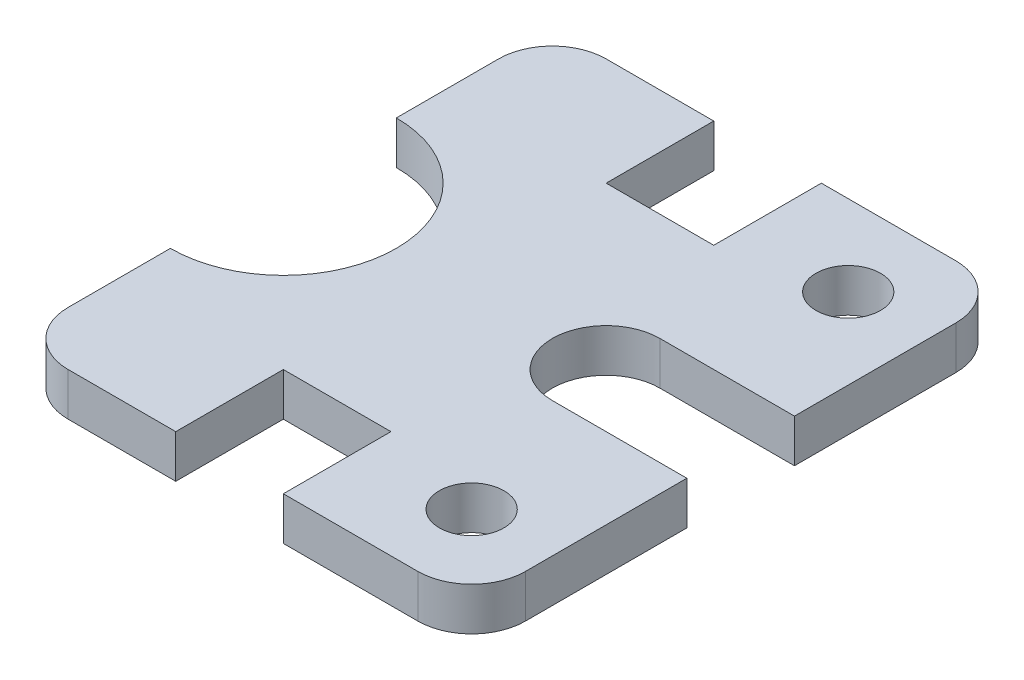
ISO-10303-21;
HEADER;
FILE_DESCRIPTION(('STEP AP214'),'2;1');
FILE_NAME('part.step','',(''),(''),'','','');
FILE_SCHEMA(('AUTOMOTIVE_DESIGN { 1 0 10303 214 1 1 1 1 }'));
ENDSEC;
DATA;
#1=APPLICATION_CONTEXT('core data for automotive mechanical design processes');
#2=APPLICATION_PROTOCOL_DEFINITION('international standard','automotive_design',2000,#1);
#3=PRODUCT_CONTEXT('',#1,'mechanical');
#4=PRODUCT('Part','Part','',(#3));
#5=PRODUCT_RELATED_PRODUCT_CATEGORY('part','',(#4));
#6=PRODUCT_DEFINITION_FORMATION('','',#4);
#7=PRODUCT_DEFINITION_CONTEXT('part definition',#1,'design');
#8=PRODUCT_DEFINITION('design','',#6,#7);
#9=PRODUCT_DEFINITION_SHAPE('','',#8);
#10=(LENGTH_UNIT() NAMED_UNIT(*) SI_UNIT(.MILLI.,.METRE.));
#11=(NAMED_UNIT(*) PLANE_ANGLE_UNIT() SI_UNIT($,.RADIAN.));
#12=(NAMED_UNIT(*) SI_UNIT($,.STERADIAN.) SOLID_ANGLE_UNIT());
#13=UNCERTAINTY_MEASURE_WITH_UNIT(LENGTH_MEASURE(1.E-05),#10,'distance_accuracy_value','');
#14=(GEOMETRIC_REPRESENTATION_CONTEXT(3) GLOBAL_UNCERTAINTY_ASSIGNED_CONTEXT((#13)) GLOBAL_UNIT_ASSIGNED_CONTEXT((#10,
#11,#12)) REPRESENTATION_CONTEXT('',''));
#15=CARTESIAN_POINT('',(0.,0.,0.));
#16=DIRECTION('',(0.,0.,1.));
#17=DIRECTION('',(1.,0.,0.));
#18=AXIS2_PLACEMENT_3D('',#15,#16,#17);
#19=CARTESIAN_POINT('',(0.,8.,10.));
#20=DIRECTION('',(0.,1.,0.));
#21=DIRECTION('',(0.,0.,1.));
#22=AXIS2_PLACEMENT_3D('',#19,#20,#21);
#23=PLANE('',#22);
#24=CARTESIAN_POINT('',(10.,8.,45.));
#25=DIRECTION('',(0.,1.,0.));
#26=DIRECTION('',(0.,0.,1.));
#27=AXIS2_PLACEMENT_3D('',#24,#25,#26);
#28=CIRCLE('',#27,6.);
#29=CARTESIAN_POINT('',(10.,8.,51.));
#30=VERTEX_POINT('',#29);
#31=EDGE_CURVE('E221',#30,#30,#28,.T.);
#32=ORIENTED_EDGE('',*,*,#31,.F.);
#33=EDGE_LOOP('',(#32));
#34=FACE_BOUND('',#33,.T.);
#35=CARTESIAN_POINT('',(0.,8.,10.));
#36=DIRECTION('',(0.,-1.,0.));
#37=DIRECTION('',(0.,0.,1.));
#38=AXIS2_PLACEMENT_3D('',#35,#36,#37);
#39=CIRCLE('',#38,10.);
#40=CARTESIAN_POINT('',(0.,8.,20.));
#41=VERTEX_POINT('',#40);
#42=CARTESIAN_POINT('',(0.,8.,0.));
#43=VERTEX_POINT('',#42);
#44=EDGE_CURVE('E260',#41,#43,#39,.T.);
#45=ORIENTED_EDGE('',*,*,#44,.T.);
#46=DIRECTION('',(1.,0.,0.));
#47=VECTOR('',#46,1.);
#48=CARTESIAN_POINT('',(0.,8.,0.));
#49=LINE('',#48,#47);
#50=CARTESIAN_POINT('',(25.,8.,0.));
#51=VERTEX_POINT('',#50);
#52=EDGE_CURVE('E138',#43,#51,#49,.T.);
#53=ORIENTED_EDGE('',*,*,#52,.T.);
#54=DIRECTION('',(0.,0.,-1.));
#55=VECTOR('',#54,1.);
#56=CARTESIAN_POINT('',(25.,8.,-29.9999999999999));
#57=LINE('',#56,#55);
#58=CARTESIAN_POINT('',(25.,8.,-29.9999999999999));
#59=VERTEX_POINT('',#58);
#60=EDGE_CURVE('E317',#51,#59,#57,.T.);
#61=ORIENTED_EDGE('',*,*,#60,.T.);
#62=CARTESIAN_POINT('',(15.,8.,-30.));
#63=DIRECTION('',(0.,1.,0.));
#64=DIRECTION('',(0.,0.,1.));
#65=AXIS2_PLACEMENT_3D('',#62,#63,#64);
#66=CIRCLE('',#65,10.);
#67=CARTESIAN_POINT('',(14.9999999999999,8.,-40.));
#68=VERTEX_POINT('',#67);
#69=EDGE_CURVE('E336',#59,#68,#66,.T.);
#70=ORIENTED_EDGE('',*,*,#69,.T.);
#71=DIRECTION('',(-1.,0.,0.));
#72=VECTOR('',#71,1.);
#73=CARTESIAN_POINT('',(-9.99999999999999,8.,-40.));
#74=LINE('',#73,#72);
#75=CARTESIAN_POINT('',(-9.99999999999999,8.,-40.));
#76=VERTEX_POINT('',#75);
#77=EDGE_CURVE('E333',#68,#76,#74,.T.);
#78=ORIENTED_EDGE('',*,*,#77,.T.);
#79=DIRECTION('',(0.,0.,1.));
#80=VECTOR('',#79,1.);
#81=CARTESIAN_POINT('',(-9.99999999999999,8.,-20.));
#82=LINE('',#81,#80);
#83=CARTESIAN_POINT('',(-9.99999999999999,8.,-20.));
#84=VERTEX_POINT('',#83);
#85=EDGE_CURVE('E335',#76,#84,#82,.T.);
#86=ORIENTED_EDGE('',*,*,#85,.T.);
#87=DIRECTION('',(-1.,0.,0.));
#88=VECTOR('',#87,1.);
#89=CARTESIAN_POINT('',(-30.,8.,-20.));
#90=LINE('',#89,#88);
#91=CARTESIAN_POINT('',(-30.,8.,-20.));
#92=VERTEX_POINT('',#91);
#93=EDGE_CURVE('E338',#84,#92,#90,.T.);
#94=ORIENTED_EDGE('',*,*,#93,.T.);
#95=DIRECTION('',(0.,0.,-1.));
#96=VECTOR('',#95,1.);
#97=CARTESIAN_POINT('',(-30.,8.,-40.));
#98=LINE('',#97,#96);
#99=CARTESIAN_POINT('',(-30.,8.,-40.));
#100=VERTEX_POINT('',#99);
#101=EDGE_CURVE('E344',#92,#100,#98,.T.);
#102=ORIENTED_EDGE('',*,*,#101,.T.);
#103=DIRECTION('',(-1.,0.,0.));
#104=VECTOR('',#103,1.);
#105=CARTESIAN_POINT('',(-50.,8.,-40.));
#106=LINE('',#105,#104);
#107=CARTESIAN_POINT('',(-50.,8.,-40.));
#108=VERTEX_POINT('',#107);
#109=EDGE_CURVE('E346',#100,#108,#106,.T.);
#110=ORIENTED_EDGE('',*,*,#109,.T.);
#111=CARTESIAN_POINT('',(-50.,8.,-30.));
#112=DIRECTION('',(0.,1.,0.));
#113=DIRECTION('',(0.,0.,-1.));
#114=AXIS2_PLACEMENT_3D('',#111,#112,#113);
#115=CIRCLE('',#114,10.);
#116=CARTESIAN_POINT('',(-60.,8.,-30.));
#117=VERTEX_POINT('',#116);
#118=EDGE_CURVE('E348',#108,#117,#115,.T.);
#119=ORIENTED_EDGE('',*,*,#118,.T.);
#120=DIRECTION('',(0.,0.,1.));
#121=VECTOR('',#120,1.);
#122=CARTESIAN_POINT('',(-60.,8.,-11.));
#123=LINE('',#122,#121);
#124=CARTESIAN_POINT('',(-60.,8.,-11.));
#125=VERTEX_POINT('',#124);
#126=EDGE_CURVE('E350',#117,#125,#123,.T.);
#127=ORIENTED_EDGE('',*,*,#126,.T.);
#128=CARTESIAN_POINT('',(-60.,8.,10.));
#129=DIRECTION('',(0.,-1.,0.));
#130=DIRECTION('',(0.,0.,1.));
#131=AXIS2_PLACEMENT_3D('',#128,#129,#130);
#132=CIRCLE('',#131,21.);
#133=CARTESIAN_POINT('',(-60.,8.,31.));
#134=VERTEX_POINT('',#133);
#135=EDGE_CURVE('E352',#125,#134,#132,.T.);
#136=ORIENTED_EDGE('',*,*,#135,.T.);
#137=DIRECTION('',(0.,0.,1.));
#138=VECTOR('',#137,1.);
#139=CARTESIAN_POINT('',(-60.,8.,50.));
#140=LINE('',#139,#138);
#141=CARTESIAN_POINT('',(-60.,8.,50.));
#142=VERTEX_POINT('',#141);
#143=EDGE_CURVE('E354',#134,#142,#140,.T.);
#144=ORIENTED_EDGE('',*,*,#143,.T.);
#145=CARTESIAN_POINT('',(-50.,8.,50.));
#146=DIRECTION('',(0.,1.,0.));
#147=DIRECTION('',(0.,0.,-1.));
#148=AXIS2_PLACEMENT_3D('',#145,#146,#147);
#149=CIRCLE('',#148,10.);
#150=CARTESIAN_POINT('',(-50.,8.,60.));
#151=VERTEX_POINT('',#150);
#152=EDGE_CURVE('E356',#142,#151,#149,.T.);
#153=ORIENTED_EDGE('',*,*,#152,.T.);
#154=DIRECTION('',(1.,0.,0.));
#155=VECTOR('',#154,1.);
#156=CARTESIAN_POINT('',(-30.,8.,60.));
#157=LINE('',#156,#155);
#158=CARTESIAN_POINT('',(-30.,8.,60.));
#159=VERTEX_POINT('',#158);
#160=EDGE_CURVE('E358',#151,#159,#157,.T.);
#161=ORIENTED_EDGE('',*,*,#160,.T.);
#162=DIRECTION('',(0.,0.,-1.));
#163=VECTOR('',#162,1.);
#164=CARTESIAN_POINT('',(-30.,8.,40.));
#165=LINE('',#164,#163);
#166=CARTESIAN_POINT('',(-30.,8.,40.));
#167=VERTEX_POINT('',#166);
#168=EDGE_CURVE('E360',#159,#167,#165,.T.);
#169=ORIENTED_EDGE('',*,*,#168,.T.);
#170=DIRECTION('',(1.,0.,0.));
#171=VECTOR('',#170,1.);
#172=CARTESIAN_POINT('',(-10.,8.,40.));
#173=LINE('',#172,#171);
#174=CARTESIAN_POINT('',(-10.,8.,40.));
#175=VERTEX_POINT('',#174);
#176=EDGE_CURVE('E362',#167,#175,#173,.T.);
#177=ORIENTED_EDGE('',*,*,#176,.T.);
#178=DIRECTION('',(0.,0.,1.));
#179=VECTOR('',#178,1.);
#180=CARTESIAN_POINT('',(-10.,8.,60.));
#181=LINE('',#180,#179);
#182=CARTESIAN_POINT('',(-10.,8.,60.));
#183=VERTEX_POINT('',#182);
#184=EDGE_CURVE('E364',#175,#183,#181,.T.);
#185=ORIENTED_EDGE('',*,*,#184,.T.);
#186=DIRECTION('',(1.,0.,0.));
#187=VECTOR('',#186,1.);
#188=CARTESIAN_POINT('',(14.9999999999999,8.,60.));
#189=LINE('',#188,#187);
#190=CARTESIAN_POINT('',(14.9999999999999,8.,60.));
#191=VERTEX_POINT('',#190);
#192=EDGE_CURVE('E199',#183,#191,#189,.T.);
#193=ORIENTED_EDGE('',*,*,#192,.T.);
#194=CARTESIAN_POINT('',(15.,8.,50.));
#195=DIRECTION('',(0.,1.,0.));
#196=DIRECTION('',(0.,0.,1.));
#197=AXIS2_PLACEMENT_3D('',#194,#195,#196);
#198=CIRCLE('',#197,10.);
#199=CARTESIAN_POINT('',(25.,8.,49.9999999999999));
#200=VERTEX_POINT('',#199);
#201=EDGE_CURVE('E193',#191,#200,#198,.T.);
#202=ORIENTED_EDGE('',*,*,#201,.T.);
#203=DIRECTION('',(0.,0.,-1.));
#204=VECTOR('',#203,1.);
#205=CARTESIAN_POINT('',(25.,8.,20.));
#206=LINE('',#205,#204);
#207=CARTESIAN_POINT('',(25.,8.,20.));
#208=VERTEX_POINT('',#207);
#209=EDGE_CURVE('E197',#200,#208,#206,.T.);
#210=ORIENTED_EDGE('',*,*,#209,.T.);
#211=DIRECTION('',(-1.,0.,0.));
#212=VECTOR('',#211,1.);
#213=CARTESIAN_POINT('',(0.,8.,20.));
#214=LINE('',#213,#212);
#215=EDGE_CURVE('E53',#208,#41,#214,.T.);
#216=ORIENTED_EDGE('',*,*,#215,.T.);
#217=EDGE_LOOP('',(#45,#53,#61,#70,#78,#86,#94,#102,#110,#119,#127,#136,#144,#153,#161,#169,
#177,#185,#193,#202,#210,#216));
#218=FACE_BOUND('',#217,.T.);
#219=CARTESIAN_POINT('',(10.,8.,-25.));
#220=DIRECTION('',(0.,1.,0.));
#221=DIRECTION('',(0.,0.,1.));
#222=AXIS2_PLACEMENT_3D('',#219,#220,#221);
#223=CIRCLE('',#222,6.);
#224=CARTESIAN_POINT('',(10.,8.,-19.));
#225=VERTEX_POINT('',#224);
#226=EDGE_CURVE('E406',#225,#225,#223,.T.);
#227=ORIENTED_EDGE('',*,*,#226,.F.);
#228=EDGE_LOOP('',(#227));
#229=FACE_BOUND('',#228,.T.);
#230=ADVANCED_FACE('F36',(#34,#218,#229),#23,.T.);
#231=CARTESIAN_POINT('',(0.,0.,10.));
#232=DIRECTION('',(0.,1.,0.));
#233=DIRECTION('',(0.,0.,1.));
#234=AXIS2_PLACEMENT_3D('',#231,#232,#233);
#235=PLANE('',#234);
#236=CARTESIAN_POINT('',(0.,0.,10.));
#237=DIRECTION('',(0.,-1.,0.));
#238=DIRECTION('',(0.,0.,1.));
#239=AXIS2_PLACEMENT_3D('',#236,#237,#238);
#240=CIRCLE('',#239,10.);
#241=CARTESIAN_POINT('',(0.,0.,20.));
#242=VERTEX_POINT('',#241);
#243=CARTESIAN_POINT('',(0.,0.,0.));
#244=VERTEX_POINT('',#243);
#245=EDGE_CURVE('E217',#242,#244,#240,.T.);
#246=ORIENTED_EDGE('',*,*,#245,.F.);
#247=DIRECTION('',(-1.,0.,0.));
#248=VECTOR('',#247,1.);
#249=CARTESIAN_POINT('',(0.,0.,20.));
#250=LINE('',#249,#248);
#251=CARTESIAN_POINT('',(25.,0.,20.));
#252=VERTEX_POINT('',#251);
#253=EDGE_CURVE('E130',#252,#242,#250,.T.);
#254=ORIENTED_EDGE('',*,*,#253,.F.);
#255=DIRECTION('',(0.,0.,-1.));
#256=VECTOR('',#255,1.);
#257=CARTESIAN_POINT('',(25.,0.,20.));
#258=LINE('',#257,#256);
#259=CARTESIAN_POINT('',(25.,0.,49.9999999999999));
#260=VERTEX_POINT('',#259);
#261=EDGE_CURVE('E124',#260,#252,#258,.T.);
#262=ORIENTED_EDGE('',*,*,#261,.F.);
#263=CARTESIAN_POINT('',(15.,0.,50.));
#264=DIRECTION('',(0.,1.,0.));
#265=DIRECTION('',(0.,0.,1.));
#266=AXIS2_PLACEMENT_3D('',#263,#264,#265);
#267=CIRCLE('',#266,10.);
#268=CARTESIAN_POINT('',(14.9999999999999,0.,60.));
#269=VERTEX_POINT('',#268);
#270=EDGE_CURVE('E207',#269,#260,#267,.T.);
#271=ORIENTED_EDGE('',*,*,#270,.F.);
#272=DIRECTION('',(1.,0.,0.));
#273=VECTOR('',#272,1.);
#274=CARTESIAN_POINT('',(14.9999999999999,0.,60.));
#275=LINE('',#274,#273);
#276=CARTESIAN_POINT('',(-10.,0.,60.));
#277=VERTEX_POINT('',#276);
#278=EDGE_CURVE('E255',#277,#269,#275,.T.);
#279=ORIENTED_EDGE('',*,*,#278,.F.);
#280=DIRECTION('',(0.,0.,1.));
#281=VECTOR('',#280,1.);
#282=CARTESIAN_POINT('',(-10.,0.,60.));
#283=LINE('',#282,#281);
#284=CARTESIAN_POINT('',(-10.,0.,40.));
#285=VERTEX_POINT('',#284);
#286=EDGE_CURVE('E253',#285,#277,#283,.T.);
#287=ORIENTED_EDGE('',*,*,#286,.F.);
#288=DIRECTION('',(1.,0.,0.));
#289=VECTOR('',#288,1.);
#290=CARTESIAN_POINT('',(-10.,0.,40.));
#291=LINE('',#290,#289);
#292=CARTESIAN_POINT('',(-30.,0.,40.));
#293=VERTEX_POINT('',#292);
#294=EDGE_CURVE('E251',#293,#285,#291,.T.);
#295=ORIENTED_EDGE('',*,*,#294,.F.);
#296=DIRECTION('',(0.,0.,-1.));
#297=VECTOR('',#296,1.);
#298=CARTESIAN_POINT('',(-30.,0.,40.));
#299=LINE('',#298,#297);
#300=CARTESIAN_POINT('',(-30.,0.,60.));
#301=VERTEX_POINT('',#300);
#302=EDGE_CURVE('E249',#301,#293,#299,.T.);
#303=ORIENTED_EDGE('',*,*,#302,.F.);
#304=DIRECTION('',(1.,0.,0.));
#305=VECTOR('',#304,1.);
#306=CARTESIAN_POINT('',(-30.,0.,60.));
#307=LINE('',#306,#305);
#308=CARTESIAN_POINT('',(-50.,0.,60.));
#309=VERTEX_POINT('',#308);
#310=EDGE_CURVE('E247',#309,#301,#307,.T.);
#311=ORIENTED_EDGE('',*,*,#310,.F.);
#312=CARTESIAN_POINT('',(-50.,0.,50.));
#313=DIRECTION('',(0.,1.,0.));
#314=DIRECTION('',(0.,0.,-1.));
#315=AXIS2_PLACEMENT_3D('',#312,#313,#314);
#316=CIRCLE('',#315,10.);
#317=CARTESIAN_POINT('',(-60.,0.,50.));
#318=VERTEX_POINT('',#317);
#319=EDGE_CURVE('E245',#318,#309,#316,.T.);
#320=ORIENTED_EDGE('',*,*,#319,.F.);
#321=DIRECTION('',(0.,0.,1.));
#322=VECTOR('',#321,1.);
#323=CARTESIAN_POINT('',(-60.,0.,50.));
#324=LINE('',#323,#322);
#325=CARTESIAN_POINT('',(-60.,0.,31.));
#326=VERTEX_POINT('',#325);
#327=EDGE_CURVE('E243',#326,#318,#324,.T.);
#328=ORIENTED_EDGE('',*,*,#327,.F.);
#329=CARTESIAN_POINT('',(-60.,0.,10.));
#330=DIRECTION('',(0.,-1.,0.));
#331=DIRECTION('',(0.,0.,1.));
#332=AXIS2_PLACEMENT_3D('',#329,#330,#331);
#333=CIRCLE('',#332,21.);
#334=CARTESIAN_POINT('',(-60.,0.,-11.));
#335=VERTEX_POINT('',#334);
#336=EDGE_CURVE('E241',#335,#326,#333,.T.);
#337=ORIENTED_EDGE('',*,*,#336,.F.);
#338=DIRECTION('',(0.,0.,1.));
#339=VECTOR('',#338,1.);
#340=CARTESIAN_POINT('',(-60.,0.,-11.));
#341=LINE('',#340,#339);
#342=CARTESIAN_POINT('',(-60.,0.,-30.));
#343=VERTEX_POINT('',#342);
#344=EDGE_CURVE('E239',#343,#335,#341,.T.);
#345=ORIENTED_EDGE('',*,*,#344,.F.);
#346=CARTESIAN_POINT('',(-50.,0.,-30.));
#347=DIRECTION('',(0.,1.,0.));
#348=DIRECTION('',(0.,0.,-1.));
#349=AXIS2_PLACEMENT_3D('',#346,#347,#348);
#350=CIRCLE('',#349,10.);
#351=CARTESIAN_POINT('',(-50.,0.,-40.));
#352=VERTEX_POINT('',#351);
#353=EDGE_CURVE('E237',#352,#343,#350,.T.);
#354=ORIENTED_EDGE('',*,*,#353,.F.);
#355=DIRECTION('',(-1.,0.,0.));
#356=VECTOR('',#355,1.);
#357=CARTESIAN_POINT('',(-50.,0.,-40.));
#358=LINE('',#357,#356);
#359=CARTESIAN_POINT('',(-30.,0.,-40.));
#360=VERTEX_POINT('',#359);
#361=EDGE_CURVE('E235',#360,#352,#358,.T.);
#362=ORIENTED_EDGE('',*,*,#361,.F.);
#363=DIRECTION('',(0.,0.,-1.));
#364=VECTOR('',#363,1.);
#365=CARTESIAN_POINT('',(-30.,0.,-40.));
#366=LINE('',#365,#364);
#367=CARTESIAN_POINT('',(-30.,0.,-20.));
#368=VERTEX_POINT('',#367);
#369=EDGE_CURVE('E233',#368,#360,#366,.T.);
#370=ORIENTED_EDGE('',*,*,#369,.F.);
#371=DIRECTION('',(-1.,0.,0.));
#372=VECTOR('',#371,1.);
#373=CARTESIAN_POINT('',(-30.,0.,-20.));
#374=LINE('',#373,#372);
#375=CARTESIAN_POINT('',(-9.99999999999999,0.,-20.));
#376=VERTEX_POINT('',#375);
#377=EDGE_CURVE('E231',#376,#368,#374,.T.);
#378=ORIENTED_EDGE('',*,*,#377,.F.);
#379=DIRECTION('',(0.,0.,1.));
#380=VECTOR('',#379,1.);
#381=CARTESIAN_POINT('',(-9.99999999999999,0.,-20.));
#382=LINE('',#381,#380);
#383=CARTESIAN_POINT('',(-9.99999999999999,0.,-40.));
#384=VERTEX_POINT('',#383);
#385=EDGE_CURVE('E229',#384,#376,#382,.T.);
#386=ORIENTED_EDGE('',*,*,#385,.F.);
#387=DIRECTION('',(-1.,0.,0.));
#388=VECTOR('',#387,1.);
#389=CARTESIAN_POINT('',(-9.99999999999999,0.,-40.));
#390=LINE('',#389,#388);
#391=CARTESIAN_POINT('',(14.9999999999999,0.,-40.));
#392=VERTEX_POINT('',#391);
#393=EDGE_CURVE('E227',#392,#384,#390,.T.);
#394=ORIENTED_EDGE('',*,*,#393,.F.);
#395=CARTESIAN_POINT('',(15.,0.,-30.));
#396=DIRECTION('',(0.,1.,0.));
#397=DIRECTION('',(0.,0.,1.));
#398=AXIS2_PLACEMENT_3D('',#395,#396,#397);
#399=CIRCLE('',#398,10.);
#400=CARTESIAN_POINT('',(25.,0.,-29.9999999999999));
#401=VERTEX_POINT('',#400);
#402=EDGE_CURVE('E225',#401,#392,#399,.T.);
#403=ORIENTED_EDGE('',*,*,#402,.F.);
#404=DIRECTION('',(0.,0.,-1.));
#405=VECTOR('',#404,1.);
#406=CARTESIAN_POINT('',(25.,0.,-29.9999999999999));
#407=LINE('',#406,#405);
#408=CARTESIAN_POINT('',(25.,0.,0.));
#409=VERTEX_POINT('',#408);
#410=EDGE_CURVE('E223',#409,#401,#407,.T.);
#411=ORIENTED_EDGE('',*,*,#410,.F.);
#412=DIRECTION('',(1.,0.,0.));
#413=VECTOR('',#412,1.);
#414=CARTESIAN_POINT('',(0.,0.,0.));
#415=LINE('',#414,#413);
#416=EDGE_CURVE('E220',#244,#409,#415,.T.);
#417=ORIENTED_EDGE('',*,*,#416,.F.);
#418=EDGE_LOOP('',(#246,#254,#262,#271,#279,#287,#295,#303,#311,#320,#328,#337,#345,#354,#362,
#370,#378,#386,#394,#403,#411,#417));
#419=FACE_BOUND('',#418,.T.);
#420=CARTESIAN_POINT('',(10.,0.,45.));
#421=DIRECTION('',(0.,1.,0.));
#422=DIRECTION('',(0.,0.,1.));
#423=AXIS2_PLACEMENT_3D('',#420,#421,#422);
#424=CIRCLE('',#423,6.);
#425=CARTESIAN_POINT('',(10.,0.,51.));
#426=VERTEX_POINT('',#425);
#427=EDGE_CURVE('E412',#426,#426,#424,.T.);
#428=ORIENTED_EDGE('',*,*,#427,.T.);
#429=EDGE_LOOP('',(#428));
#430=FACE_BOUND('',#429,.T.);
#431=CARTESIAN_POINT('',(10.,0.,-25.));
#432=DIRECTION('',(0.,1.,0.));
#433=DIRECTION('',(0.,0.,1.));
#434=AXIS2_PLACEMENT_3D('',#431,#432,#433);
#435=CIRCLE('',#434,6.);
#436=CARTESIAN_POINT('',(10.,0.,-19.));
#437=VERTEX_POINT('',#436);
#438=EDGE_CURVE('E409',#437,#437,#435,.T.);
#439=ORIENTED_EDGE('',*,*,#438,.T.);
#440=EDGE_LOOP('',(#439));
#441=FACE_BOUND('',#440,.T.);
#442=ADVANCED_FACE('F321',(#419,#430,#441),#235,.F.);
#443=CARTESIAN_POINT('',(0.,8.,10.));
#444=DIRECTION('',(0.,-1.,0.));
#445=DIRECTION('',(0.,0.,-1.));
#446=AXIS2_PLACEMENT_3D('',#443,#444,#445);
#447=CYLINDRICAL_SURFACE('',#446,10.);
#448=ORIENTED_EDGE('',*,*,#245,.T.);
#449=DIRECTION('',(0.,-1.,0.));
#450=VECTOR('',#449,1.);
#451=CARTESIAN_POINT('',(0.,8.,0.));
#452=LINE('',#451,#450);
#453=EDGE_CURVE('E11',#43,#244,#452,.T.);
#454=ORIENTED_EDGE('',*,*,#453,.F.);
#455=ORIENTED_EDGE('',*,*,#44,.F.);
#456=DIRECTION('',(0.,-1.,0.));
#457=VECTOR('',#456,1.);
#458=CARTESIAN_POINT('',(0.,8.,20.));
#459=LINE('',#458,#457);
#460=EDGE_CURVE('E213',#41,#242,#459,.T.);
#461=ORIENTED_EDGE('',*,*,#460,.T.);
#462=EDGE_LOOP('',(#448,#454,#455,#461));
#463=FACE_BOUND('',#462,.T.);
#464=ADVANCED_FACE('F38',(#463),#447,.F.);
#465=CARTESIAN_POINT('',(0.,8.,0.));
#466=DIRECTION('',(0.,0.,-1.));
#467=DIRECTION('',(-1.,0.,0.));
#468=AXIS2_PLACEMENT_3D('',#465,#466,#467);
#469=PLANE('',#468);
#470=ORIENTED_EDGE('',*,*,#416,.T.);
#471=DIRECTION('',(0.,-1.,0.));
#472=VECTOR('',#471,1.);
#473=CARTESIAN_POINT('',(25.,8.,0.));
#474=LINE('',#473,#472);
#475=EDGE_CURVE('E45',#51,#409,#474,.T.);
#476=ORIENTED_EDGE('',*,*,#475,.F.);
#477=ORIENTED_EDGE('',*,*,#52,.F.);
#478=ORIENTED_EDGE('',*,*,#453,.T.);
#479=EDGE_LOOP('',(#470,#476,#477,#478));
#480=FACE_BOUND('',#479,.T.);
#481=ADVANCED_FACE('F605',(#480),#469,.F.);
#482=CARTESIAN_POINT('',(25.,8.,-29.9999999999999));
#483=DIRECTION('',(-1.,0.,0.));
#484=DIRECTION('',(0.,0.,1.));
#485=AXIS2_PLACEMENT_3D('',#482,#483,#484);
#486=PLANE('',#485);
#487=ORIENTED_EDGE('',*,*,#410,.T.);
#488=DIRECTION('',(0.,-1.,0.));
#489=VECTOR('',#488,1.);
#490=CARTESIAN_POINT('',(25.,8.,-29.9999999999999));
#491=LINE('',#490,#489);
#492=EDGE_CURVE('E309',#59,#401,#491,.T.);
#493=ORIENTED_EDGE('',*,*,#492,.F.);
#494=ORIENTED_EDGE('',*,*,#60,.F.);
#495=ORIENTED_EDGE('',*,*,#475,.T.);
#496=EDGE_LOOP('',(#487,#493,#494,#495));
#497=FACE_BOUND('',#496,.T.);
#498=ADVANCED_FACE('F315',(#497),#486,.F.);
#499=CARTESIAN_POINT('',(15.,8.,-30.));
#500=DIRECTION('',(0.,-1.,0.));
#501=DIRECTION('',(0.,0.,-1.));
#502=AXIS2_PLACEMENT_3D('',#499,#500,#501);
#503=CYLINDRICAL_SURFACE('',#502,10.);
#504=ORIENTED_EDGE('',*,*,#402,.T.);
#505=DIRECTION('',(0.,-1.,0.));
#506=VECTOR('',#505,1.);
#507=CARTESIAN_POINT('',(14.9999999999999,8.,-40.));
#508=LINE('',#507,#506);
#509=EDGE_CURVE('E306',#68,#392,#508,.T.);
#510=ORIENTED_EDGE('',*,*,#509,.F.);
#511=ORIENTED_EDGE('',*,*,#69,.F.);
#512=ORIENTED_EDGE('',*,*,#492,.T.);
#513=EDGE_LOOP('',(#504,#510,#511,#512));
#514=FACE_BOUND('',#513,.T.);
#515=ADVANCED_FACE('F327',(#514),#503,.T.);
#516=CARTESIAN_POINT('',(-9.99999999999999,8.,-40.));
#517=DIRECTION('',(0.,0.,1.));
#518=DIRECTION('',(1.,0.,0.));
#519=AXIS2_PLACEMENT_3D('',#516,#517,#518);
#520=PLANE('',#519);
#521=ORIENTED_EDGE('',*,*,#393,.T.);
#522=DIRECTION('',(0.,-1.,0.));
#523=VECTOR('',#522,1.);
#524=CARTESIAN_POINT('',(-9.99999999999999,8.,-40.));
#525=LINE('',#524,#523);
#526=EDGE_CURVE('E303',#76,#384,#525,.T.);
#527=ORIENTED_EDGE('',*,*,#526,.F.);
#528=ORIENTED_EDGE('',*,*,#77,.F.);
#529=ORIENTED_EDGE('',*,*,#509,.T.);
#530=EDGE_LOOP('',(#521,#527,#528,#529));
#531=FACE_BOUND('',#530,.T.);
#532=ADVANCED_FACE('F331',(#531),#520,.F.);
#533=CARTESIAN_POINT('',(-9.99999999999999,8.,-20.));
#534=DIRECTION('',(1.,0.,0.));
#535=DIRECTION('',(0.,0.,-1.));
#536=AXIS2_PLACEMENT_3D('',#533,#534,#535);
#537=PLANE('',#536);
#538=ORIENTED_EDGE('',*,*,#385,.T.);
#539=DIRECTION('',(0.,-1.,0.));
#540=VECTOR('',#539,1.);
#541=CARTESIAN_POINT('',(-9.99999999999999,8.,-20.));
#542=LINE('',#541,#540);
#543=EDGE_CURVE('E300',#84,#376,#542,.T.);
#544=ORIENTED_EDGE('',*,*,#543,.F.);
#545=ORIENTED_EDGE('',*,*,#85,.F.);
#546=ORIENTED_EDGE('',*,*,#526,.T.);
#547=EDGE_LOOP('',(#538,#544,#545,#546));
#548=FACE_BOUND('',#547,.T.);
#549=ADVANCED_FACE('F570',(#548),#537,.F.);
#550=CARTESIAN_POINT('',(-30.,8.,-20.));
#551=DIRECTION('',(0.,0.,1.));
#552=DIRECTION('',(1.,0.,0.));
#553=AXIS2_PLACEMENT_3D('',#550,#551,#552);
#554=PLANE('',#553);
#555=ORIENTED_EDGE('',*,*,#377,.T.);
#556=DIRECTION('',(0.,-1.,0.));
#557=VECTOR('',#556,1.);
#558=CARTESIAN_POINT('',(-30.,8.,-20.));
#559=LINE('',#558,#557);
#560=EDGE_CURVE('E297',#92,#368,#559,.T.);
#561=ORIENTED_EDGE('',*,*,#560,.F.);
#562=ORIENTED_EDGE('',*,*,#93,.F.);
#563=ORIENTED_EDGE('',*,*,#543,.T.);
#564=EDGE_LOOP('',(#555,#561,#562,#563));
#565=FACE_BOUND('',#564,.T.);
#566=ADVANCED_FACE('F560',(#565),#554,.F.);
#567=CARTESIAN_POINT('',(-30.,8.,-40.));
#568=DIRECTION('',(-1.,0.,0.));
#569=DIRECTION('',(0.,0.,1.));
#570=AXIS2_PLACEMENT_3D('',#567,#568,#569);
#571=PLANE('',#570);
#572=ORIENTED_EDGE('',*,*,#369,.T.);
#573=DIRECTION('',(0.,-1.,0.));
#574=VECTOR('',#573,1.);
#575=CARTESIAN_POINT('',(-30.,8.,-40.));
#576=LINE('',#575,#574);
#577=EDGE_CURVE('E294',#100,#360,#576,.T.);
#578=ORIENTED_EDGE('',*,*,#577,.F.);
#579=ORIENTED_EDGE('',*,*,#101,.F.);
#580=ORIENTED_EDGE('',*,*,#560,.T.);
#581=EDGE_LOOP('',(#572,#578,#579,#580));
#582=FACE_BOUND('',#581,.T.);
#583=ADVANCED_FACE('F550',(#582),#571,.F.);
#584=CARTESIAN_POINT('',(-50.,8.,-40.));
#585=DIRECTION('',(0.,0.,1.));
#586=DIRECTION('',(1.,0.,0.));
#587=AXIS2_PLACEMENT_3D('',#584,#585,#586);
#588=PLANE('',#587);
#589=ORIENTED_EDGE('',*,*,#361,.T.);
#590=DIRECTION('',(0.,-1.,0.));
#591=VECTOR('',#590,1.);
#592=CARTESIAN_POINT('',(-50.,8.,-40.));
#593=LINE('',#592,#591);
#594=EDGE_CURVE('E291',#108,#352,#593,.T.);
#595=ORIENTED_EDGE('',*,*,#594,.F.);
#596=ORIENTED_EDGE('',*,*,#109,.F.);
#597=ORIENTED_EDGE('',*,*,#577,.T.);
#598=EDGE_LOOP('',(#589,#595,#596,#597));
#599=FACE_BOUND('',#598,.T.);
#600=ADVANCED_FACE('F540',(#599),#588,.F.);
#601=CARTESIAN_POINT('',(-50.,8.,-30.));
#602=DIRECTION('',(0.,-1.,0.));
#603=DIRECTION('',(0.,0.,-1.));
#604=AXIS2_PLACEMENT_3D('',#601,#602,#603);
#605=CYLINDRICAL_SURFACE('',#604,10.);
#606=ORIENTED_EDGE('',*,*,#353,.T.);
#607=DIRECTION('',(0.,-1.,0.));
#608=VECTOR('',#607,1.);
#609=CARTESIAN_POINT('',(-60.,8.,-30.));
#610=LINE('',#609,#608);
#611=EDGE_CURVE('E288',#117,#343,#610,.T.);
#612=ORIENTED_EDGE('',*,*,#611,.F.);
#613=ORIENTED_EDGE('',*,*,#118,.F.);
#614=ORIENTED_EDGE('',*,*,#594,.T.);
#615=EDGE_LOOP('',(#606,#612,#613,#614));
#616=FACE_BOUND('',#615,.T.);
#617=ADVANCED_FACE('F530',(#616),#605,.T.);
#618=CARTESIAN_POINT('',(-60.,8.,-11.));
#619=DIRECTION('',(1.,0.,0.));
#620=DIRECTION('',(0.,0.,-1.));
#621=AXIS2_PLACEMENT_3D('',#618,#619,#620);
#622=PLANE('',#621);
#623=ORIENTED_EDGE('',*,*,#344,.T.);
#624=DIRECTION('',(0.,-1.,0.));
#625=VECTOR('',#624,1.);
#626=CARTESIAN_POINT('',(-60.,8.,-11.));
#627=LINE('',#626,#625);
#628=EDGE_CURVE('E285',#125,#335,#627,.T.);
#629=ORIENTED_EDGE('',*,*,#628,.F.);
#630=ORIENTED_EDGE('',*,*,#126,.F.);
#631=ORIENTED_EDGE('',*,*,#611,.T.);
#632=EDGE_LOOP('',(#623,#629,#630,#631));
#633=FACE_BOUND('',#632,.T.);
#634=ADVANCED_FACE('F520',(#633),#622,.F.);
#635=CARTESIAN_POINT('',(-60.,8.,10.));
#636=DIRECTION('',(0.,-1.,0.));
#637=DIRECTION('',(0.,0.,-1.));
#638=AXIS2_PLACEMENT_3D('',#635,#636,#637);
#639=CYLINDRICAL_SURFACE('',#638,21.);
#640=ORIENTED_EDGE('',*,*,#336,.T.);
#641=DIRECTION('',(0.,-1.,0.));
#642=VECTOR('',#641,1.);
#643=CARTESIAN_POINT('',(-60.,8.,31.));
#644=LINE('',#643,#642);
#645=EDGE_CURVE('E282',#134,#326,#644,.T.);
#646=ORIENTED_EDGE('',*,*,#645,.F.);
#647=ORIENTED_EDGE('',*,*,#135,.F.);
#648=ORIENTED_EDGE('',*,*,#628,.T.);
#649=EDGE_LOOP('',(#640,#646,#647,#648));
#650=FACE_BOUND('',#649,.T.);
#651=ADVANCED_FACE('F510',(#650),#639,.F.);
#652=CARTESIAN_POINT('',(-60.,8.,50.));
#653=DIRECTION('',(1.,0.,0.));
#654=DIRECTION('',(0.,0.,-1.));
#655=AXIS2_PLACEMENT_3D('',#652,#653,#654);
#656=PLANE('',#655);
#657=ORIENTED_EDGE('',*,*,#327,.T.);
#658=DIRECTION('',(0.,-1.,0.));
#659=VECTOR('',#658,1.);
#660=CARTESIAN_POINT('',(-60.,8.,50.));
#661=LINE('',#660,#659);
#662=EDGE_CURVE('E279',#142,#318,#661,.T.);
#663=ORIENTED_EDGE('',*,*,#662,.F.);
#664=ORIENTED_EDGE('',*,*,#143,.F.);
#665=ORIENTED_EDGE('',*,*,#645,.T.);
#666=EDGE_LOOP('',(#657,#663,#664,#665));
#667=FACE_BOUND('',#666,.T.);
#668=ADVANCED_FACE('F500',(#667),#656,.F.);
#669=CARTESIAN_POINT('',(-50.,8.,50.));
#670=DIRECTION('',(0.,-1.,0.));
#671=DIRECTION('',(0.,0.,-1.));
#672=AXIS2_PLACEMENT_3D('',#669,#670,#671);
#673=CYLINDRICAL_SURFACE('',#672,10.);
#674=ORIENTED_EDGE('',*,*,#319,.T.);
#675=DIRECTION('',(0.,-1.,0.));
#676=VECTOR('',#675,1.);
#677=CARTESIAN_POINT('',(-50.,8.,60.));
#678=LINE('',#677,#676);
#679=EDGE_CURVE('E276',#151,#309,#678,.T.);
#680=ORIENTED_EDGE('',*,*,#679,.F.);
#681=ORIENTED_EDGE('',*,*,#152,.F.);
#682=ORIENTED_EDGE('',*,*,#662,.T.);
#683=EDGE_LOOP('',(#674,#680,#681,#682));
#684=FACE_BOUND('',#683,.T.);
#685=ADVANCED_FACE('F490',(#684),#673,.T.);
#686=CARTESIAN_POINT('',(-30.,8.,60.));
#687=DIRECTION('',(0.,0.,-1.));
#688=DIRECTION('',(-1.,0.,0.));
#689=AXIS2_PLACEMENT_3D('',#686,#687,#688);
#690=PLANE('',#689);
#691=ORIENTED_EDGE('',*,*,#310,.T.);
#692=DIRECTION('',(0.,-1.,0.));
#693=VECTOR('',#692,1.);
#694=CARTESIAN_POINT('',(-30.,8.,60.));
#695=LINE('',#694,#693);
#696=EDGE_CURVE('E273',#159,#301,#695,.T.);
#697=ORIENTED_EDGE('',*,*,#696,.F.);
#698=ORIENTED_EDGE('',*,*,#160,.F.);
#699=ORIENTED_EDGE('',*,*,#679,.T.);
#700=EDGE_LOOP('',(#691,#697,#698,#699));
#701=FACE_BOUND('',#700,.T.);
#702=ADVANCED_FACE('F480',(#701),#690,.F.);
#703=CARTESIAN_POINT('',(-30.,8.,40.));
#704=DIRECTION('',(-1.,0.,0.));
#705=DIRECTION('',(0.,0.,1.));
#706=AXIS2_PLACEMENT_3D('',#703,#704,#705);
#707=PLANE('',#706);
#708=ORIENTED_EDGE('',*,*,#302,.T.);
#709=DIRECTION('',(0.,-1.,0.));
#710=VECTOR('',#709,1.);
#711=CARTESIAN_POINT('',(-30.,8.,40.));
#712=LINE('',#711,#710);
#713=EDGE_CURVE('E270',#167,#293,#712,.T.);
#714=ORIENTED_EDGE('',*,*,#713,.F.);
#715=ORIENTED_EDGE('',*,*,#168,.F.);
#716=ORIENTED_EDGE('',*,*,#696,.T.);
#717=EDGE_LOOP('',(#708,#714,#715,#716));
#718=FACE_BOUND('',#717,.T.);
#719=ADVANCED_FACE('F470',(#718),#707,.F.);
#720=CARTESIAN_POINT('',(-10.,8.,40.));
#721=DIRECTION('',(0.,0.,-1.));
#722=DIRECTION('',(-1.,0.,0.));
#723=AXIS2_PLACEMENT_3D('',#720,#721,#722);
#724=PLANE('',#723);
#725=ORIENTED_EDGE('',*,*,#294,.T.);
#726=DIRECTION('',(0.,-1.,0.));
#727=VECTOR('',#726,1.);
#728=CARTESIAN_POINT('',(-10.,8.,40.));
#729=LINE('',#728,#727);
#730=EDGE_CURVE('E267',#175,#285,#729,.T.);
#731=ORIENTED_EDGE('',*,*,#730,.F.);
#732=ORIENTED_EDGE('',*,*,#176,.F.);
#733=ORIENTED_EDGE('',*,*,#713,.T.);
#734=EDGE_LOOP('',(#725,#731,#732,#733));
#735=FACE_BOUND('',#734,.T.);
#736=ADVANCED_FACE('F461',(#735),#724,.F.);
#737=CARTESIAN_POINT('',(-10.,8.,60.));
#738=DIRECTION('',(1.,0.,0.));
#739=DIRECTION('',(0.,0.,-1.));
#740=AXIS2_PLACEMENT_3D('',#737,#738,#739);
#741=PLANE('',#740);
#742=ORIENTED_EDGE('',*,*,#286,.T.);
#743=DIRECTION('',(0.,-1.,0.));
#744=VECTOR('',#743,1.);
#745=CARTESIAN_POINT('',(-10.,8.,60.));
#746=LINE('',#745,#744);
#747=EDGE_CURVE('E264',#183,#277,#746,.T.);
#748=ORIENTED_EDGE('',*,*,#747,.F.);
#749=ORIENTED_EDGE('',*,*,#184,.F.);
#750=ORIENTED_EDGE('',*,*,#730,.T.);
#751=EDGE_LOOP('',(#742,#748,#749,#750));
#752=FACE_BOUND('',#751,.T.);
#753=ADVANCED_FACE('F370',(#752),#741,.F.);
#754=CARTESIAN_POINT('',(14.9999999999999,8.,60.));
#755=DIRECTION('',(0.,0.,-1.));
#756=DIRECTION('',(-1.,0.,0.));
#757=AXIS2_PLACEMENT_3D('',#754,#755,#756);
#758=PLANE('',#757);
#759=ORIENTED_EDGE('',*,*,#278,.T.);
#760=DIRECTION('',(0.,-1.,0.));
#761=VECTOR('',#760,1.);
#762=CARTESIAN_POINT('',(14.9999999999999,8.,60.));
#763=LINE('',#762,#761);
#764=EDGE_CURVE('E208',#191,#269,#763,.T.);
#765=ORIENTED_EDGE('',*,*,#764,.F.);
#766=ORIENTED_EDGE('',*,*,#192,.F.);
#767=ORIENTED_EDGE('',*,*,#747,.T.);
#768=EDGE_LOOP('',(#759,#765,#766,#767));
#769=FACE_BOUND('',#768,.T.);
#770=ADVANCED_FACE('F374',(#769),#758,.F.);
#771=CARTESIAN_POINT('',(15.,8.,50.));
#772=DIRECTION('',(0.,-1.,0.));
#773=DIRECTION('',(0.,0.,-1.));
#774=AXIS2_PLACEMENT_3D('',#771,#772,#773);
#775=CYLINDRICAL_SURFACE('',#774,10.);
#776=ORIENTED_EDGE('',*,*,#270,.T.);
#777=DIRECTION('',(0.,-1.,0.));
#778=VECTOR('',#777,1.);
#779=CARTESIAN_POINT('',(25.,8.,49.9999999999999));
#780=LINE('',#779,#778);
#781=EDGE_CURVE('E204',#200,#260,#780,.T.);
#782=ORIENTED_EDGE('',*,*,#781,.F.);
#783=ORIENTED_EDGE('',*,*,#201,.F.);
#784=ORIENTED_EDGE('',*,*,#764,.T.);
#785=EDGE_LOOP('',(#776,#782,#783,#784));
#786=FACE_BOUND('',#785,.T.);
#787=ADVANCED_FACE('F205',(#786),#775,.T.);
#788=CARTESIAN_POINT('',(25.,8.,20.));
#789=DIRECTION('',(-1.,0.,0.));
#790=DIRECTION('',(0.,0.,1.));
#791=AXIS2_PLACEMENT_3D('',#788,#789,#790);
#792=PLANE('',#791);
#793=ORIENTED_EDGE('',*,*,#261,.T.);
#794=DIRECTION('',(0.,-1.,0.));
#795=VECTOR('',#794,1.);
#796=CARTESIAN_POINT('',(25.,8.,20.));
#797=LINE('',#796,#795);
#798=EDGE_CURVE('E209',#208,#252,#797,.T.);
#799=ORIENTED_EDGE('',*,*,#798,.F.);
#800=ORIENTED_EDGE('',*,*,#209,.F.);
#801=ORIENTED_EDGE('',*,*,#781,.T.);
#802=EDGE_LOOP('',(#793,#799,#800,#801));
#803=FACE_BOUND('',#802,.T.);
#804=ADVANCED_FACE('F211',(#803),#792,.F.);
#805=CARTESIAN_POINT('',(0.,8.,20.));
#806=DIRECTION('',(0.,0.,1.));
#807=DIRECTION('',(1.,0.,0.));
#808=AXIS2_PLACEMENT_3D('',#805,#806,#807);
#809=PLANE('',#808);
#810=ORIENTED_EDGE('',*,*,#253,.T.);
#811=ORIENTED_EDGE('',*,*,#460,.F.);
#812=ORIENTED_EDGE('',*,*,#215,.F.);
#813=ORIENTED_EDGE('',*,*,#798,.T.);
#814=EDGE_LOOP('',(#810,#811,#812,#813));
#815=FACE_BOUND('',#814,.T.);
#816=ADVANCED_FACE('F378',(#815),#809,.F.);
#817=CARTESIAN_POINT('',(10.,8.,45.));
#818=DIRECTION('',(0.,-1.,0.));
#819=DIRECTION('',(0.,0.,-1.));
#820=AXIS2_PLACEMENT_3D('',#817,#818,#819);
#821=CYLINDRICAL_SURFACE('',#820,6.);
#822=ORIENTED_EDGE('',*,*,#31,.T.);
#823=EDGE_LOOP('',(#822));
#824=FACE_BOUND('',#823,.T.);
#825=ORIENTED_EDGE('',*,*,#427,.F.);
#826=EDGE_LOOP('',(#825));
#827=FACE_BOUND('',#826,.T.);
#828=ADVANCED_FACE('F380',(#824,#827),#821,.F.);
#829=CARTESIAN_POINT('',(10.,8.,-25.));
#830=DIRECTION('',(0.,-1.,0.));
#831=DIRECTION('',(0.,0.,-1.));
#832=AXIS2_PLACEMENT_3D('',#829,#830,#831);
#833=CYLINDRICAL_SURFACE('',#832,6.);
#834=ORIENTED_EDGE('',*,*,#226,.T.);
#835=EDGE_LOOP('',(#834));
#836=FACE_BOUND('',#835,.T.);
#837=ORIENTED_EDGE('',*,*,#438,.F.);
#838=EDGE_LOOP('',(#837));
#839=FACE_BOUND('',#838,.T.);
#840=ADVANCED_FACE('F386',(#836,#839),#833,.F.);
#841=CLOSED_SHELL('',(#230,#442,#464,#481,#498,#515,#532,#549,#566,#583,#600,#617,#634,#651,
#668,#685,#702,#719,#736,#753,#770,#787,#804,#816,#828,#840));
#842=MANIFOLD_SOLID_BREP('B2',#841);
#843=ADVANCED_BREP_SHAPE_REPRESENTATION('',(#18,#842),#14);
#844=SHAPE_DEFINITION_REPRESENTATION(#9,#843);
ENDSEC;
END-ISO-10303-21;
